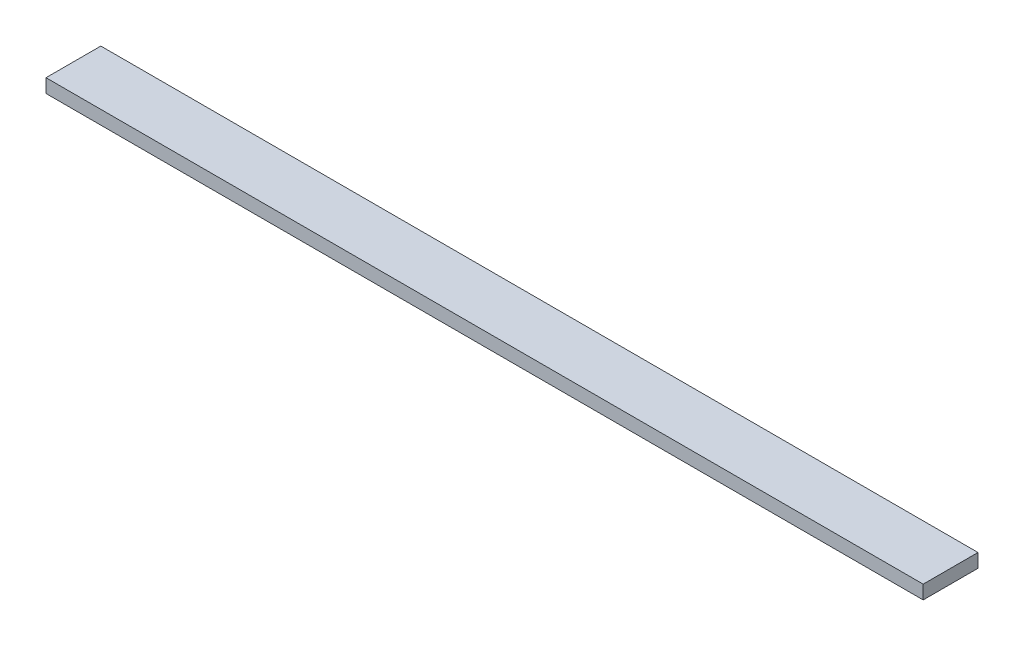
ISO-10303-21;
HEADER;
FILE_DESCRIPTION(('STEP AP214'),'2;1');
FILE_NAME('part.step','',(''),(''),'','','');
FILE_SCHEMA(('AUTOMOTIVE_DESIGN { 1 0 10303 214 1 1 1 1 }'));
ENDSEC;
DATA;
#1=APPLICATION_CONTEXT('core data for automotive mechanical design processes');
#2=APPLICATION_PROTOCOL_DEFINITION('international standard','automotive_design',2000,#1);
#3=PRODUCT_CONTEXT('',#1,'mechanical');
#4=PRODUCT('Part','Part','',(#3));
#5=PRODUCT_RELATED_PRODUCT_CATEGORY('part','',(#4));
#6=PRODUCT_DEFINITION_FORMATION('','',#4);
#7=PRODUCT_DEFINITION_CONTEXT('part definition',#1,'design');
#8=PRODUCT_DEFINITION('design','',#6,#7);
#9=PRODUCT_DEFINITION_SHAPE('','',#8);
#10=(LENGTH_UNIT() NAMED_UNIT(*) SI_UNIT(.MILLI.,.METRE.));
#11=(NAMED_UNIT(*) PLANE_ANGLE_UNIT() SI_UNIT($,.RADIAN.));
#12=(NAMED_UNIT(*) SI_UNIT($,.STERADIAN.) SOLID_ANGLE_UNIT());
#13=UNCERTAINTY_MEASURE_WITH_UNIT(LENGTH_MEASURE(1.E-05),#10,'distance_accuracy_value','');
#14=(GEOMETRIC_REPRESENTATION_CONTEXT(3) GLOBAL_UNCERTAINTY_ASSIGNED_CONTEXT((#13)) GLOBAL_UNIT_ASSIGNED_CONTEXT((#10,
#11,#12)) REPRESENTATION_CONTEXT('',''));
#15=CARTESIAN_POINT('',(0.,0.,0.));
#16=DIRECTION('',(0.,0.,1.));
#17=DIRECTION('',(1.,0.,0.));
#18=AXIS2_PLACEMENT_3D('',#15,#16,#17);
#19=CARTESIAN_POINT('',(211.2,-3.05,12.2));
#20=DIRECTION('',(0.,0.,-1.));
#21=DIRECTION('',(-1.,0.,0.));
#22=AXIS2_PLACEMENT_3D('',#19,#20,#21);
#23=PLANE('',#22);
#24=DIRECTION('',(0.,-1.,0.));
#25=VECTOR('',#24,1.);
#26=CARTESIAN_POINT('',(-195.2,-3.05,12.2));
#27=LINE('',#26,#25);
#28=CARTESIAN_POINT('',(-195.2,3.3,12.2));
#29=VERTEX_POINT('',#28);
#30=CARTESIAN_POINT('',(-195.2,-3.05,12.2));
#31=VERTEX_POINT('',#30);
#32=EDGE_CURVE('E98',#29,#31,#27,.T.);
#33=ORIENTED_EDGE('',*,*,#32,.T.);
#34=DIRECTION('',(-1.,0.,0.));
#35=VECTOR('',#34,1.);
#36=CARTESIAN_POINT('',(211.2,-3.05,12.2));
#37=LINE('',#36,#35);
#38=CARTESIAN_POINT('',(211.2,-3.05,12.2));
#39=VERTEX_POINT('',#38);
#40=EDGE_CURVE('E11',#39,#31,#37,.T.);
#41=ORIENTED_EDGE('',*,*,#40,.F.);
#42=DIRECTION('',(0.,-1.,0.));
#43=VECTOR('',#42,1.);
#44=CARTESIAN_POINT('',(211.2,-3.05,12.2));
#45=LINE('',#44,#43);
#46=CARTESIAN_POINT('',(211.2,3.3,12.2));
#47=VERTEX_POINT('',#46);
#48=EDGE_CURVE('E86',#47,#39,#45,.T.);
#49=ORIENTED_EDGE('',*,*,#48,.F.);
#50=DIRECTION('',(-1.,0.,0.));
#51=VECTOR('',#50,1.);
#52=CARTESIAN_POINT('',(211.2,3.3,12.2));
#53=LINE('',#52,#51);
#54=EDGE_CURVE('E94',#47,#29,#53,.T.);
#55=ORIENTED_EDGE('',*,*,#54,.T.);
#56=EDGE_LOOP('',(#33,#41,#49,#55));
#57=FACE_BOUND('',#56,.T.);
#58=ADVANCED_FACE('F35',(#57),#23,.F.);
#59=CARTESIAN_POINT('',(211.2,-3.05,12.2));
#60=DIRECTION('',(0.,1.,0.));
#61=DIRECTION('',(0.,0.,1.));
#62=AXIS2_PLACEMENT_3D('',#59,#60,#61);
#63=PLANE('',#62);
#64=DIRECTION('',(0.,0.,-1.));
#65=VECTOR('',#64,1.);
#66=CARTESIAN_POINT('',(-195.2,-3.05,12.2));
#67=LINE('',#66,#65);
#68=CARTESIAN_POINT('',(-195.2,-3.05,-13.2));
#69=VERTEX_POINT('',#68);
#70=EDGE_CURVE('E90',#31,#69,#67,.T.);
#71=ORIENTED_EDGE('',*,*,#70,.T.);
#72=DIRECTION('',(-1.,0.,0.));
#73=VECTOR('',#72,1.);
#74=CARTESIAN_POINT('',(211.2,-3.05,-13.2));
#75=LINE('',#74,#73);
#76=CARTESIAN_POINT('',(211.2,-3.05,-13.2));
#77=VERTEX_POINT('',#76);
#78=EDGE_CURVE('E43',#77,#69,#75,.T.);
#79=ORIENTED_EDGE('',*,*,#78,.F.);
#80=DIRECTION('',(0.,0.,-1.));
#81=VECTOR('',#80,1.);
#82=CARTESIAN_POINT('',(211.2,-3.05,12.2));
#83=LINE('',#82,#81);
#84=EDGE_CURVE('E81',#39,#77,#83,.T.);
#85=ORIENTED_EDGE('',*,*,#84,.F.);
#86=ORIENTED_EDGE('',*,*,#40,.T.);
#87=EDGE_LOOP('',(#71,#79,#85,#86));
#88=FACE_BOUND('',#87,.T.);
#89=ADVANCED_FACE('F89',(#88),#63,.F.);
#90=CARTESIAN_POINT('',(211.2,-3.05,-13.2));
#91=DIRECTION('',(0.,0.,1.));
#92=DIRECTION('',(1.,0.,0.));
#93=AXIS2_PLACEMENT_3D('',#90,#91,#92);
#94=PLANE('',#93);
#95=DIRECTION('',(0.,1.,0.));
#96=VECTOR('',#95,1.);
#97=CARTESIAN_POINT('',(-195.2,-3.05,-13.2));
#98=LINE('',#97,#96);
#99=CARTESIAN_POINT('',(-195.2,3.3,-13.2));
#100=VERTEX_POINT('',#99);
#101=EDGE_CURVE('E68',#69,#100,#98,.T.);
#102=ORIENTED_EDGE('',*,*,#101,.T.);
#103=DIRECTION('',(-1.,0.,0.));
#104=VECTOR('',#103,1.);
#105=CARTESIAN_POINT('',(211.2,3.3,-13.2));
#106=LINE('',#105,#104);
#107=CARTESIAN_POINT('',(211.2,3.3,-13.2));
#108=VERTEX_POINT('',#107);
#109=EDGE_CURVE('E91',#108,#100,#106,.T.);
#110=ORIENTED_EDGE('',*,*,#109,.F.);
#111=DIRECTION('',(0.,1.,0.));
#112=VECTOR('',#111,1.);
#113=CARTESIAN_POINT('',(211.2,-3.05,-13.2));
#114=LINE('',#113,#112);
#115=EDGE_CURVE('E84',#77,#108,#114,.T.);
#116=ORIENTED_EDGE('',*,*,#115,.F.);
#117=ORIENTED_EDGE('',*,*,#78,.T.);
#118=EDGE_LOOP('',(#102,#110,#116,#117));
#119=FACE_BOUND('',#118,.T.);
#120=ADVANCED_FACE('F92',(#119),#94,.F.);
#121=CARTESIAN_POINT('',(211.2,3.3,12.2));
#122=DIRECTION('',(0.,-1.,0.));
#123=DIRECTION('',(0.,0.,-1.));
#124=AXIS2_PLACEMENT_3D('',#121,#122,#123);
#125=PLANE('',#124);
#126=DIRECTION('',(0.,0.,1.));
#127=VECTOR('',#126,1.);
#128=CARTESIAN_POINT('',(-195.2,3.3,12.2));
#129=LINE('',#128,#127);
#130=EDGE_CURVE('E74',#100,#29,#129,.T.);
#131=ORIENTED_EDGE('',*,*,#130,.T.);
#132=ORIENTED_EDGE('',*,*,#54,.F.);
#133=DIRECTION('',(0.,0.,1.));
#134=VECTOR('',#133,1.);
#135=CARTESIAN_POINT('',(211.2,3.3,12.2));
#136=LINE('',#135,#134);
#137=EDGE_CURVE('E51',#108,#47,#136,.T.);
#138=ORIENTED_EDGE('',*,*,#137,.F.);
#139=ORIENTED_EDGE('',*,*,#109,.T.);
#140=EDGE_LOOP('',(#131,#132,#138,#139));
#141=FACE_BOUND('',#140,.T.);
#142=ADVANCED_FACE('F105',(#141),#125,.F.);
#143=CARTESIAN_POINT('',(211.2,-3.05,12.2));
#144=DIRECTION('',(-1.,0.,0.));
#145=DIRECTION('',(0.,0.,1.));
#146=AXIS2_PLACEMENT_3D('',#143,#144,#145);
#147=PLANE('',#146);
#148=ORIENTED_EDGE('',*,*,#48,.T.);
#149=ORIENTED_EDGE('',*,*,#84,.T.);
#150=ORIENTED_EDGE('',*,*,#115,.T.);
#151=ORIENTED_EDGE('',*,*,#137,.T.);
#152=EDGE_LOOP('',(#148,#149,#150,#151));
#153=FACE_BOUND('',#152,.T.);
#154=ADVANCED_FACE('F82',(#153),#147,.F.);
#155=CARTESIAN_POINT('',(-195.2,-3.05,12.2));
#156=DIRECTION('',(-1.,0.,0.));
#157=DIRECTION('',(0.,0.,1.));
#158=AXIS2_PLACEMENT_3D('',#155,#156,#157);
#159=PLANE('',#158);
#160=ORIENTED_EDGE('',*,*,#32,.F.);
#161=ORIENTED_EDGE('',*,*,#130,.F.);
#162=ORIENTED_EDGE('',*,*,#101,.F.);
#163=ORIENTED_EDGE('',*,*,#70,.F.);
#164=EDGE_LOOP('',(#160,#161,#162,#163));
#165=FACE_BOUND('',#164,.T.);
#166=ADVANCED_FACE('F108',(#165),#159,.T.);
#167=CLOSED_SHELL('',(#58,#89,#120,#142,#154,#166));
#168=MANIFOLD_SOLID_BREP('B2',#167);
#169=ADVANCED_BREP_SHAPE_REPRESENTATION('',(#18,#168),#14);
#170=SHAPE_DEFINITION_REPRESENTATION(#9,#169);
ENDSEC;
END-ISO-10303-21;
